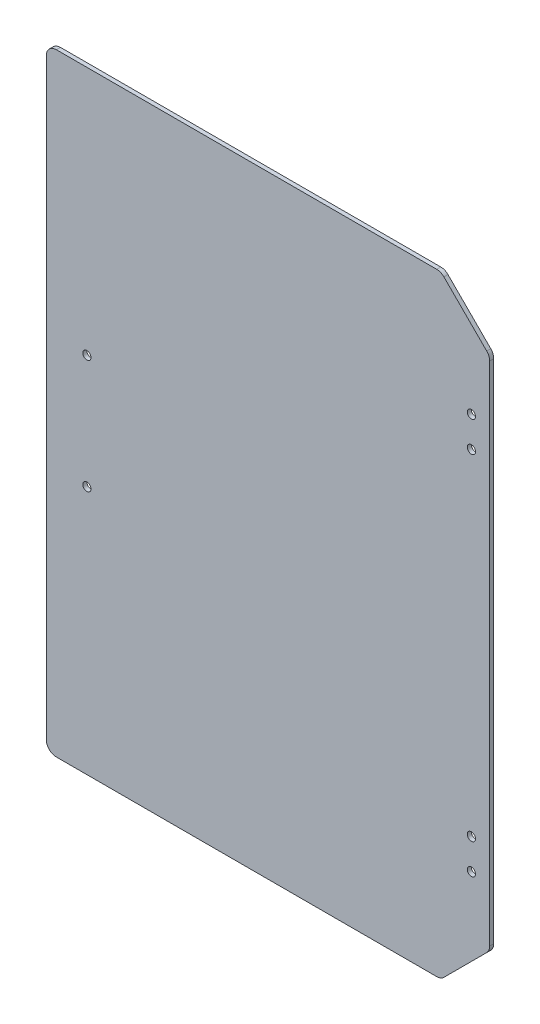
ISO-10303-21;
HEADER;
FILE_DESCRIPTION(('STEP AP214'),'2;1');
FILE_NAME('part.step','',(''),(''),'','','');
FILE_SCHEMA(('AUTOMOTIVE_DESIGN { 1 0 10303 214 1 1 1 1 }'));
ENDSEC;
DATA;
#1=APPLICATION_CONTEXT('core data for automotive mechanical design processes');
#2=APPLICATION_PROTOCOL_DEFINITION('international standard','automotive_design',2000,#1);
#3=PRODUCT_CONTEXT('',#1,'mechanical');
#4=PRODUCT('Part','Part','',(#3));
#5=PRODUCT_RELATED_PRODUCT_CATEGORY('part','',(#4));
#6=PRODUCT_DEFINITION_FORMATION('','',#4);
#7=PRODUCT_DEFINITION_CONTEXT('part definition',#1,'design');
#8=PRODUCT_DEFINITION('design','',#6,#7);
#9=PRODUCT_DEFINITION_SHAPE('','',#8);
#10=(LENGTH_UNIT() NAMED_UNIT(*) SI_UNIT(.MILLI.,.METRE.));
#11=(NAMED_UNIT(*) PLANE_ANGLE_UNIT() SI_UNIT($,.RADIAN.));
#12=(NAMED_UNIT(*) SI_UNIT($,.STERADIAN.) SOLID_ANGLE_UNIT());
#13=UNCERTAINTY_MEASURE_WITH_UNIT(LENGTH_MEASURE(1.E-05),#10,'distance_accuracy_value','');
#14=(GEOMETRIC_REPRESENTATION_CONTEXT(3) GLOBAL_UNCERTAINTY_ASSIGNED_CONTEXT((#13)) GLOBAL_UNIT_ASSIGNED_CONTEXT((#10,
#11,#12)) REPRESENTATION_CONTEXT('',''));
#15=CARTESIAN_POINT('',(0.,0.,0.));
#16=DIRECTION('',(0.,0.,1.));
#17=DIRECTION('',(1.,0.,0.));
#18=AXIS2_PLACEMENT_3D('',#15,#16,#17);
#19=CARTESIAN_POINT('',(0.,0.,4.));
#20=DIRECTION('',(0.,0.,-1.));
#21=DIRECTION('',(-1.,0.,0.));
#22=AXIS2_PLACEMENT_3D('',#19,#20,#21);
#23=PLANE('',#22);
#24=CARTESIAN_POINT('',(-198.144386368956,56.9354419410745,4.));
#25=DIRECTION('',(0.,0.,1.));
#26=DIRECTION('',(1.,0.,0.));
#27=AXIS2_PLACEMENT_3D('',#24,#25,#26);
#28=CIRCLE('',#27,4.04999999999999);
#29=CARTESIAN_POINT('',(-194.094386368956,56.9354419410745,4.));
#30=VERTEX_POINT('',#29);
#31=EDGE_CURVE('E262',#30,#30,#28,.T.);
#32=ORIENTED_EDGE('',*,*,#31,.F.);
#33=EDGE_LOOP('',(#32));
#34=FACE_BOUND('',#33,.T.);
#35=CARTESIAN_POINT('',(-198.144386368956,-55.0645580589255,4.));
#36=DIRECTION('',(0.,0.,1.));
#37=DIRECTION('',(1.,0.,0.));
#38=AXIS2_PLACEMENT_3D('',#35,#36,#37);
#39=CIRCLE('',#38,4.04999999999999);
#40=CARTESIAN_POINT('',(-194.094386368956,-55.0645580589255,4.));
#41=VERTEX_POINT('',#40);
#42=EDGE_CURVE('E256',#41,#41,#39,.T.);
#43=ORIENTED_EDGE('',*,*,#42,.F.);
#44=EDGE_LOOP('',(#43));
#45=FACE_BOUND('',#44,.T.);
#46=DIRECTION('',(-1.,0.,0.));
#47=VECTOR('',#46,1.);
#48=CARTESIAN_POINT('',(-238.144386368956,302.435441941074,4.));
#49=LINE('',#48,#47);
#50=CARTESIAN_POINT('',(146.213478007298,302.435441941074,4.));
#51=VERTEX_POINT('',#50);
#52=CARTESIAN_POINT('',(-228.144386368956,302.435441941074,4.));
#53=VERTEX_POINT('',#52);
#54=EDGE_CURVE('E159',#51,#53,#49,.T.);
#55=ORIENTED_EDGE('',*,*,#54,.T.);
#56=CARTESIAN_POINT('',(-228.144386368956,292.435441941074,4.));
#57=DIRECTION('',(0.,0.,-1.));
#58=DIRECTION('',(-1.,0.,0.));
#59=AXIS2_PLACEMENT_3D('',#56,#57,#58);
#60=CIRCLE('',#59,10.);
#61=CARTESIAN_POINT('',(-238.144386368956,292.435441941074,4.));
#62=VERTEX_POINT('',#61);
#63=EDGE_CURVE('E192',#53,#62,#60,.F.);
#64=ORIENTED_EDGE('',*,*,#63,.T.);
#65=DIRECTION('',(0.,-1.,0.));
#66=VECTOR('',#65,1.);
#67=CARTESIAN_POINT('',(-238.144386368956,-300.564558058925,4.));
#68=LINE('',#67,#66);
#69=CARTESIAN_POINT('',(-238.144386368956,-290.564558058925,4.));
#70=VERTEX_POINT('',#69);
#71=EDGE_CURVE('E142',#62,#70,#68,.T.);
#72=ORIENTED_EDGE('',*,*,#71,.T.);
#73=CARTESIAN_POINT('',(-228.144386368956,-290.564558058925,4.));
#74=DIRECTION('',(0.,0.,-1.));
#75=DIRECTION('',(-1.,0.,0.));
#76=AXIS2_PLACEMENT_3D('',#73,#74,#75);
#77=CIRCLE('',#76,10.);
#78=CARTESIAN_POINT('',(-228.144386368956,-300.564558058925,4.));
#79=VERTEX_POINT('',#78);
#80=EDGE_CURVE('E190',#70,#79,#77,.F.);
#81=ORIENTED_EDGE('',*,*,#80,.T.);
#82=DIRECTION('',(1.,0.,0.));
#83=VECTOR('',#82,1.);
#84=CARTESIAN_POINT('',(-238.144386368956,-300.564558058925,4.));
#85=LINE('',#84,#83);
#86=CARTESIAN_POINT('',(146.2134780073,-300.564558058925,4.));
#87=VERTEX_POINT('',#86);
#88=EDGE_CURVE('E231',#79,#87,#85,.T.);
#89=ORIENTED_EDGE('',*,*,#88,.T.);
#90=CARTESIAN_POINT('',(146.2134780073,-290.564558058925,4.));
#91=DIRECTION('',(0.,0.,-1.));
#92=DIRECTION('',(-1.,0.,0.));
#93=AXIS2_PLACEMENT_3D('',#90,#91,#92);
#94=CIRCLE('',#93,10.);
#95=CARTESIAN_POINT('',(153.284545819165,-297.635625870791,4.));
#96=VERTEX_POINT('',#95);
#97=EDGE_CURVE('E188',#87,#96,#94,.F.);
#98=ORIENTED_EDGE('',*,*,#97,.T.);
#99=DIRECTION('',(0.707106781186548,0.707106781186548,0.));
#100=VECTOR('',#99,1.);
#101=CARTESIAN_POINT('',(150.355613631031,-300.564558058925,4.));
#102=LINE('',#101,#100);
#103=CARTESIAN_POINT('',(195.426681442896,-255.49349024706,4.));
#104=VERTEX_POINT('',#103);
#105=EDGE_CURVE('E226',#96,#104,#102,.T.);
#106=ORIENTED_EDGE('',*,*,#105,.T.);
#107=CARTESIAN_POINT('',(188.355613631031,-248.422422435194,4.));
#108=DIRECTION('',(0.,0.,-1.));
#109=DIRECTION('',(-1.,0.,0.));
#110=AXIS2_PLACEMENT_3D('',#107,#108,#109);
#111=CIRCLE('',#110,10.);
#112=CARTESIAN_POINT('',(198.355613631031,-248.422422435194,4.));
#113=VERTEX_POINT('',#112);
#114=EDGE_CURVE('E186',#104,#113,#111,.F.);
#115=ORIENTED_EDGE('',*,*,#114,.T.);
#116=DIRECTION('',(0.,1.,0.));
#117=VECTOR('',#116,1.);
#118=CARTESIAN_POINT('',(198.355613631031,254.435441941074,4.));
#119=LINE('',#118,#117);
#120=CARTESIAN_POINT('',(198.355613631031,250.293306317343,4.));
#121=VERTEX_POINT('',#120);
#122=EDGE_CURVE('E214',#113,#121,#119,.T.);
#123=ORIENTED_EDGE('',*,*,#122,.T.);
#124=CARTESIAN_POINT('',(188.355613631031,250.293306317343,4.));
#125=DIRECTION('',(0.,0.,-1.));
#126=DIRECTION('',(-1.,0.,0.));
#127=AXIS2_PLACEMENT_3D('',#124,#125,#126);
#128=CIRCLE('',#127,10.);
#129=CARTESIAN_POINT('',(195.426681442896,257.364374129209,4.));
#130=VERTEX_POINT('',#129);
#131=EDGE_CURVE('E53',#121,#130,#128,.F.);
#132=ORIENTED_EDGE('',*,*,#131,.T.);
#133=DIRECTION('',(-0.707106781186557,0.707106781186539,0.));
#134=VECTOR('',#133,1.);
#135=CARTESIAN_POINT('',(150.355613631029,302.435441941074,4.));
#136=LINE('',#135,#134);
#137=CARTESIAN_POINT('',(153.284545819164,299.50650975294,4.));
#138=VERTEX_POINT('',#137);
#139=EDGE_CURVE('E223',#130,#138,#136,.T.);
#140=ORIENTED_EDGE('',*,*,#139,.T.);
#141=CARTESIAN_POINT('',(146.213478007298,292.435441941074,4.));
#142=DIRECTION('',(0.,0.,-1.));
#143=DIRECTION('',(-1.,0.,0.));
#144=AXIS2_PLACEMENT_3D('',#141,#142,#143);
#145=CIRCLE('',#144,10.);
#146=EDGE_CURVE('E183',#138,#51,#145,.F.);
#147=ORIENTED_EDGE('',*,*,#146,.T.);
#148=EDGE_LOOP('',(#55,#64,#72,#81,#89,#98,#106,#115,#123,#132,#140,#147));
#149=FACE_BOUND('',#148,.T.);
#150=CARTESIAN_POINT('',(180.355613631041,195.935441941075,4.));
#151=DIRECTION('',(0.,0.,1.));
#152=DIRECTION('',(1.,0.,0.));
#153=AXIS2_PLACEMENT_3D('',#150,#151,#152);
#154=CIRCLE('',#153,4.04999999999967);
#155=CARTESIAN_POINT('',(184.405613631041,195.935441941075,4.));
#156=VERTEX_POINT('',#155);
#157=EDGE_CURVE('E150',#156,#156,#154,.T.);
#158=ORIENTED_EDGE('',*,*,#157,.F.);
#159=EDGE_LOOP('',(#158));
#160=FACE_BOUND('',#159,.T.);
#161=CARTESIAN_POINT('',(180.355613631041,165.935441941075,4.));
#162=DIRECTION('',(0.,0.,1.));
#163=DIRECTION('',(1.,0.,0.));
#164=AXIS2_PLACEMENT_3D('',#161,#162,#163);
#165=CIRCLE('',#164,4.04999999999967);
#166=CARTESIAN_POINT('',(184.405613631041,165.935441941075,4.));
#167=VERTEX_POINT('',#166);
#168=EDGE_CURVE('E236',#167,#167,#165,.T.);
#169=ORIENTED_EDGE('',*,*,#168,.F.);
#170=EDGE_LOOP('',(#169));
#171=FACE_BOUND('',#170,.T.);
#172=CARTESIAN_POINT('',(180.355613631041,-164.064558058926,4.));
#173=DIRECTION('',(0.,0.,1.));
#174=DIRECTION('',(1.,0.,0.));
#175=AXIS2_PLACEMENT_3D('',#172,#173,#174);
#176=CIRCLE('',#175,4.04999999999967);
#177=CARTESIAN_POINT('',(184.405613631041,-164.064558058926,4.));
#178=VERTEX_POINT('',#177);
#179=EDGE_CURVE('E241',#178,#178,#176,.T.);
#180=ORIENTED_EDGE('',*,*,#179,.F.);
#181=EDGE_LOOP('',(#180));
#182=FACE_BOUND('',#181,.T.);
#183=CARTESIAN_POINT('',(180.355613631041,-194.064558058925,4.));
#184=DIRECTION('',(0.,0.,1.));
#185=DIRECTION('',(1.,0.,0.));
#186=AXIS2_PLACEMENT_3D('',#183,#184,#185);
#187=CIRCLE('',#186,4.04999999999967);
#188=CARTESIAN_POINT('',(184.405613631041,-194.064558058925,4.));
#189=VERTEX_POINT('',#188);
#190=EDGE_CURVE('E247',#189,#189,#187,.T.);
#191=ORIENTED_EDGE('',*,*,#190,.F.);
#192=EDGE_LOOP('',(#191));
#193=FACE_BOUND('',#192,.T.);
#194=ADVANCED_FACE('F32',(#34,#45,#149,#160,#171,#182,#193),#23,.F.);
#195=CARTESIAN_POINT('',(0.,0.,0.));
#196=DIRECTION('',(0.,0.,-1.));
#197=DIRECTION('',(-1.,0.,0.));
#198=AXIS2_PLACEMENT_3D('',#195,#196,#197);
#199=PLANE('',#198);
#200=CARTESIAN_POINT('',(-198.144386368956,56.9354419410745,0.));
#201=DIRECTION('',(0.,0.,1.));
#202=DIRECTION('',(1.,0.,0.));
#203=AXIS2_PLACEMENT_3D('',#200,#201,#202);
#204=CIRCLE('',#203,4.04999999999999);
#205=CARTESIAN_POINT('',(-194.094386368956,56.9354419410745,0.));
#206=VERTEX_POINT('',#205);
#207=EDGE_CURVE('E253',#206,#206,#204,.T.);
#208=ORIENTED_EDGE('',*,*,#207,.T.);
#209=EDGE_LOOP('',(#208));
#210=FACE_BOUND('',#209,.T.);
#211=CARTESIAN_POINT('',(-198.144386368956,-55.0645580589255,0.));
#212=DIRECTION('',(0.,0.,1.));
#213=DIRECTION('',(1.,0.,0.));
#214=AXIS2_PLACEMENT_3D('',#211,#212,#213);
#215=CIRCLE('',#214,4.04999999999999);
#216=CARTESIAN_POINT('',(-194.094386368956,-55.0645580589255,0.));
#217=VERTEX_POINT('',#216);
#218=EDGE_CURVE('E259',#217,#217,#215,.T.);
#219=ORIENTED_EDGE('',*,*,#218,.T.);
#220=EDGE_LOOP('',(#219));
#221=FACE_BOUND('',#220,.T.);
#222=CARTESIAN_POINT('',(180.355613631041,-164.064558058926,0.));
#223=DIRECTION('',(0.,0.,1.));
#224=DIRECTION('',(1.,0.,0.));
#225=AXIS2_PLACEMENT_3D('',#222,#223,#224);
#226=CIRCLE('',#225,4.04999999999967);
#227=CARTESIAN_POINT('',(184.405613631041,-164.064558058926,0.));
#228=VERTEX_POINT('',#227);
#229=EDGE_CURVE('E244',#228,#228,#226,.T.);
#230=ORIENTED_EDGE('',*,*,#229,.T.);
#231=EDGE_LOOP('',(#230));
#232=FACE_BOUND('',#231,.T.);
#233=CARTESIAN_POINT('',(180.355613631041,195.935441941075,0.));
#234=DIRECTION('',(0.,0.,1.));
#235=DIRECTION('',(1.,0.,0.));
#236=AXIS2_PLACEMENT_3D('',#233,#234,#235);
#237=CIRCLE('',#236,4.04999999999967);
#238=CARTESIAN_POINT('',(184.405613631041,195.935441941075,0.));
#239=VERTEX_POINT('',#238);
#240=EDGE_CURVE('E156',#239,#239,#237,.T.);
#241=ORIENTED_EDGE('',*,*,#240,.T.);
#242=EDGE_LOOP('',(#241));
#243=FACE_BOUND('',#242,.T.);
#244=DIRECTION('',(0.,-1.,0.));
#245=VECTOR('',#244,1.);
#246=CARTESIAN_POINT('',(-238.144386368956,-300.564558058925,0.));
#247=LINE('',#246,#245);
#248=CARTESIAN_POINT('',(-238.144386368956,292.435441941074,0.));
#249=VERTEX_POINT('',#248);
#250=CARTESIAN_POINT('',(-238.144386368956,-290.564558058925,0.));
#251=VERTEX_POINT('',#250);
#252=EDGE_CURVE('E139',#249,#251,#247,.T.);
#253=ORIENTED_EDGE('',*,*,#252,.F.);
#254=CARTESIAN_POINT('',(-228.144386368956,292.435441941074,0.));
#255=DIRECTION('',(0.,0.,-1.));
#256=DIRECTION('',(-1.,0.,0.));
#257=AXIS2_PLACEMENT_3D('',#254,#255,#256);
#258=CIRCLE('',#257,10.);
#259=CARTESIAN_POINT('',(-228.144386368956,302.435441941074,0.));
#260=VERTEX_POINT('',#259);
#261=EDGE_CURVE('E122',#249,#260,#258,.T.);
#262=ORIENTED_EDGE('',*,*,#261,.T.);
#263=DIRECTION('',(-1.,0.,0.));
#264=VECTOR('',#263,1.);
#265=CARTESIAN_POINT('',(-238.144386368956,302.435441941074,0.));
#266=LINE('',#265,#264);
#267=CARTESIAN_POINT('',(146.213478007298,302.435441941074,0.));
#268=VERTEX_POINT('',#267);
#269=EDGE_CURVE('E169',#268,#260,#266,.T.);
#270=ORIENTED_EDGE('',*,*,#269,.F.);
#271=CARTESIAN_POINT('',(146.213478007298,292.435441941074,0.));
#272=DIRECTION('',(0.,0.,-1.));
#273=DIRECTION('',(-1.,0.,0.));
#274=AXIS2_PLACEMENT_3D('',#271,#272,#273);
#275=CIRCLE('',#274,10.);
#276=CARTESIAN_POINT('',(153.284545819164,299.50650975294,0.));
#277=VERTEX_POINT('',#276);
#278=EDGE_CURVE('E143',#268,#277,#275,.T.);
#279=ORIENTED_EDGE('',*,*,#278,.T.);
#280=DIRECTION('',(-0.707106781186557,0.707106781186539,0.));
#281=VECTOR('',#280,1.);
#282=CARTESIAN_POINT('',(150.355613631029,302.435441941074,0.));
#283=LINE('',#282,#281);
#284=CARTESIAN_POINT('',(195.426681442896,257.364374129209,0.));
#285=VERTEX_POINT('',#284);
#286=EDGE_CURVE('E167',#285,#277,#283,.T.);
#287=ORIENTED_EDGE('',*,*,#286,.F.);
#288=CARTESIAN_POINT('',(188.355613631031,250.293306317343,0.));
#289=DIRECTION('',(0.,0.,-1.));
#290=DIRECTION('',(-1.,0.,0.));
#291=AXIS2_PLACEMENT_3D('',#288,#289,#290);
#292=CIRCLE('',#291,10.);
#293=CARTESIAN_POINT('',(198.355613631031,250.293306317343,0.));
#294=VERTEX_POINT('',#293);
#295=EDGE_CURVE('E173',#285,#294,#292,.T.);
#296=ORIENTED_EDGE('',*,*,#295,.T.);
#297=DIRECTION('',(0.,1.,0.));
#298=VECTOR('',#297,1.);
#299=CARTESIAN_POINT('',(198.355613631031,254.435441941074,0.));
#300=LINE('',#299,#298);
#301=CARTESIAN_POINT('',(198.355613631031,-248.422422435194,0.));
#302=VERTEX_POINT('',#301);
#303=EDGE_CURVE('E164',#302,#294,#300,.T.);
#304=ORIENTED_EDGE('',*,*,#303,.F.);
#305=CARTESIAN_POINT('',(188.355613631031,-248.422422435194,0.));
#306=DIRECTION('',(0.,0.,-1.));
#307=DIRECTION('',(-1.,0.,0.));
#308=AXIS2_PLACEMENT_3D('',#305,#306,#307);
#309=CIRCLE('',#308,10.);
#310=CARTESIAN_POINT('',(195.426681442896,-255.49349024706,0.));
#311=VERTEX_POINT('',#310);
#312=EDGE_CURVE('E175',#302,#311,#309,.T.);
#313=ORIENTED_EDGE('',*,*,#312,.T.);
#314=DIRECTION('',(0.707106781186548,0.707106781186548,0.));
#315=VECTOR('',#314,1.);
#316=CARTESIAN_POINT('',(150.355613631031,-300.564558058925,0.));
#317=LINE('',#316,#315);
#318=CARTESIAN_POINT('',(153.284545819165,-297.635625870791,0.));
#319=VERTEX_POINT('',#318);
#320=EDGE_CURVE('E153',#319,#311,#317,.T.);
#321=ORIENTED_EDGE('',*,*,#320,.F.);
#322=CARTESIAN_POINT('',(146.2134780073,-290.564558058925,0.));
#323=DIRECTION('',(0.,0.,-1.));
#324=DIRECTION('',(-1.,0.,0.));
#325=AXIS2_PLACEMENT_3D('',#322,#323,#324);
#326=CIRCLE('',#325,10.);
#327=CARTESIAN_POINT('',(146.2134780073,-300.564558058925,0.));
#328=VERTEX_POINT('',#327);
#329=EDGE_CURVE('E177',#319,#328,#326,.T.);
#330=ORIENTED_EDGE('',*,*,#329,.T.);
#331=DIRECTION('',(1.,0.,0.));
#332=VECTOR('',#331,1.);
#333=CARTESIAN_POINT('',(-238.144386368956,-300.564558058925,0.));
#334=LINE('',#333,#332);
#335=CARTESIAN_POINT('',(-228.144386368956,-300.564558058925,0.));
#336=VERTEX_POINT('',#335);
#337=EDGE_CURVE('E149',#336,#328,#334,.T.);
#338=ORIENTED_EDGE('',*,*,#337,.F.);
#339=CARTESIAN_POINT('',(-228.144386368956,-290.564558058925,0.));
#340=DIRECTION('',(0.,0.,-1.));
#341=DIRECTION('',(-1.,0.,0.));
#342=AXIS2_PLACEMENT_3D('',#339,#340,#341);
#343=CIRCLE('',#342,10.);
#344=EDGE_CURVE('E133',#336,#251,#343,.T.);
#345=ORIENTED_EDGE('',*,*,#344,.T.);
#346=EDGE_LOOP('',(#253,#262,#270,#279,#287,#296,#304,#313,#321,#330,#338,#345));
#347=FACE_BOUND('',#346,.T.);
#348=CARTESIAN_POINT('',(180.355613631041,165.935441941075,0.));
#349=DIRECTION('',(0.,0.,1.));
#350=DIRECTION('',(1.,0.,0.));
#351=AXIS2_PLACEMENT_3D('',#348,#349,#350);
#352=CIRCLE('',#351,4.04999999999967);
#353=CARTESIAN_POINT('',(184.405613631041,165.935441941075,0.));
#354=VERTEX_POINT('',#353);
#355=EDGE_CURVE('E238',#354,#354,#352,.T.);
#356=ORIENTED_EDGE('',*,*,#355,.T.);
#357=EDGE_LOOP('',(#356));
#358=FACE_BOUND('',#357,.T.);
#359=CARTESIAN_POINT('',(180.355613631041,-194.064558058925,0.));
#360=DIRECTION('',(0.,0.,1.));
#361=DIRECTION('',(1.,0.,0.));
#362=AXIS2_PLACEMENT_3D('',#359,#360,#361);
#363=CIRCLE('',#362,4.04999999999967);
#364=CARTESIAN_POINT('',(184.405613631041,-194.064558058925,0.));
#365=VERTEX_POINT('',#364);
#366=EDGE_CURVE('E250',#365,#365,#363,.T.);
#367=ORIENTED_EDGE('',*,*,#366,.T.);
#368=EDGE_LOOP('',(#367));
#369=FACE_BOUND('',#368,.T.);
#370=ADVANCED_FACE('F146',(#210,#221,#232,#243,#347,#358,#369),#199,.T.);
#371=CARTESIAN_POINT('',(-238.144386368956,-300.564558058925,4.));
#372=DIRECTION('',(1.,0.,0.));
#373=DIRECTION('',(0.,0.,-1.));
#374=AXIS2_PLACEMENT_3D('',#371,#372,#373);
#375=PLANE('',#374);
#376=ORIENTED_EDGE('',*,*,#71,.F.);
#377=DIRECTION('',(0.,0.,-1.));
#378=VECTOR('',#377,1.);
#379=CARTESIAN_POINT('',(-238.144386368956,292.435441941074,4.));
#380=LINE('',#379,#378);
#381=EDGE_CURVE('E126',#62,#249,#380,.T.);
#382=ORIENTED_EDGE('',*,*,#381,.T.);
#383=ORIENTED_EDGE('',*,*,#252,.T.);
#384=DIRECTION('',(0.,0.,-1.));
#385=VECTOR('',#384,1.);
#386=CARTESIAN_POINT('',(-238.144386368956,-290.564558058925,4.));
#387=LINE('',#386,#385);
#388=EDGE_CURVE('E144',#251,#70,#387,.F.);
#389=ORIENTED_EDGE('',*,*,#388,.T.);
#390=EDGE_LOOP('',(#376,#382,#383,#389));
#391=FACE_BOUND('',#390,.T.);
#392=ADVANCED_FACE('F138',(#391),#375,.F.);
#393=CARTESIAN_POINT('',(-238.144386368956,-300.564558058925,4.));
#394=DIRECTION('',(0.,1.,0.));
#395=DIRECTION('',(-1.,0.,0.));
#396=AXIS2_PLACEMENT_3D('',#393,#394,#395);
#397=PLANE('',#396);
#398=ORIENTED_EDGE('',*,*,#88,.F.);
#399=DIRECTION('',(0.,0.,-1.));
#400=VECTOR('',#399,1.);
#401=CARTESIAN_POINT('',(-228.144386368956,-300.564558058925,4.));
#402=LINE('',#401,#400);
#403=EDGE_CURVE('E196',#79,#336,#402,.T.);
#404=ORIENTED_EDGE('',*,*,#403,.T.);
#405=ORIENTED_EDGE('',*,*,#337,.T.);
#406=DIRECTION('',(0.,0.,-1.));
#407=VECTOR('',#406,1.);
#408=CARTESIAN_POINT('',(146.2134780073,-300.564558058925,4.));
#409=LINE('',#408,#407);
#410=EDGE_CURVE('E194',#328,#87,#409,.F.);
#411=ORIENTED_EDGE('',*,*,#410,.T.);
#412=EDGE_LOOP('',(#398,#404,#405,#411));
#413=FACE_BOUND('',#412,.T.);
#414=ADVANCED_FACE('F303',(#413),#397,.F.);
#415=CARTESIAN_POINT('',(150.355613631031,-300.564558058925,4.));
#416=DIRECTION('',(-0.707106781186547,0.707106781186547,0.));
#417=DIRECTION('',(-0.707106781186548,-0.707106781186548,0.));
#418=AXIS2_PLACEMENT_3D('',#415,#416,#417);
#419=PLANE('',#418);
#420=ORIENTED_EDGE('',*,*,#105,.F.);
#421=DIRECTION('',(0.,0.,-1.));
#422=VECTOR('',#421,1.);
#423=CARTESIAN_POINT('',(153.284545819165,-297.635625870791,4.));
#424=LINE('',#423,#422);
#425=EDGE_CURVE('E201',#96,#319,#424,.T.);
#426=ORIENTED_EDGE('',*,*,#425,.T.);
#427=ORIENTED_EDGE('',*,*,#320,.T.);
#428=DIRECTION('',(0.,0.,-1.));
#429=VECTOR('',#428,1.);
#430=CARTESIAN_POINT('',(195.426681442896,-255.49349024706,4.));
#431=LINE('',#430,#429);
#432=EDGE_CURVE('E199',#311,#104,#431,.F.);
#433=ORIENTED_EDGE('',*,*,#432,.T.);
#434=EDGE_LOOP('',(#420,#426,#427,#433));
#435=FACE_BOUND('',#434,.T.);
#436=ADVANCED_FACE('F316',(#435),#419,.F.);
#437=CARTESIAN_POINT('',(198.355613631031,254.435441941074,4.));
#438=DIRECTION('',(-1.,0.,0.));
#439=DIRECTION('',(0.,0.,1.));
#440=AXIS2_PLACEMENT_3D('',#437,#438,#439);
#441=PLANE('',#440);
#442=ORIENTED_EDGE('',*,*,#122,.F.);
#443=DIRECTION('',(0.,0.,-1.));
#444=VECTOR('',#443,1.);
#445=CARTESIAN_POINT('',(198.355613631031,-248.422422435194,4.));
#446=LINE('',#445,#444);
#447=EDGE_CURVE('E206',#113,#302,#446,.T.);
#448=ORIENTED_EDGE('',*,*,#447,.T.);
#449=ORIENTED_EDGE('',*,*,#303,.T.);
#450=DIRECTION('',(0.,0.,-1.));
#451=VECTOR('',#450,1.);
#452=CARTESIAN_POINT('',(198.355613631031,250.293306317343,4.));
#453=LINE('',#452,#451);
#454=EDGE_CURVE('E204',#294,#121,#453,.F.);
#455=ORIENTED_EDGE('',*,*,#454,.T.);
#456=EDGE_LOOP('',(#442,#448,#449,#455));
#457=FACE_BOUND('',#456,.T.);
#458=ADVANCED_FACE('F212',(#457),#441,.F.);
#459=CARTESIAN_POINT('',(150.355613631029,302.435441941074,4.));
#460=DIRECTION('',(-0.707106781186539,-0.707106781186557,0.));
#461=DIRECTION('',(0.707106781186557,-0.707106781186539,0.));
#462=AXIS2_PLACEMENT_3D('',#459,#460,#461);
#463=PLANE('',#462);
#464=ORIENTED_EDGE('',*,*,#139,.F.);
#465=DIRECTION('',(0.,0.,-1.));
#466=VECTOR('',#465,1.);
#467=CARTESIAN_POINT('',(195.426681442896,257.364374129209,4.));
#468=LINE('',#467,#466);
#469=EDGE_CURVE('E11',#130,#285,#468,.T.);
#470=ORIENTED_EDGE('',*,*,#469,.T.);
#471=ORIENTED_EDGE('',*,*,#286,.T.);
#472=DIRECTION('',(0.,0.,-1.));
#473=VECTOR('',#472,1.);
#474=CARTESIAN_POINT('',(153.284545819164,299.50650975294,4.));
#475=LINE('',#474,#473);
#476=EDGE_CURVE('E40',#277,#138,#475,.F.);
#477=ORIENTED_EDGE('',*,*,#476,.T.);
#478=EDGE_LOOP('',(#464,#470,#471,#477));
#479=FACE_BOUND('',#478,.T.);
#480=ADVANCED_FACE('F222',(#479),#463,.F.);
#481=CARTESIAN_POINT('',(-238.144386368956,302.435441941074,4.));
#482=DIRECTION('',(0.,-1.,0.));
#483=DIRECTION('',(1.,0.,0.));
#484=AXIS2_PLACEMENT_3D('',#481,#482,#483);
#485=PLANE('',#484);
#486=ORIENTED_EDGE('',*,*,#269,.T.);
#487=DIRECTION('',(0.,0.,-1.));
#488=VECTOR('',#487,1.);
#489=CARTESIAN_POINT('',(-228.144386368956,302.435441941074,4.));
#490=LINE('',#489,#488);
#491=EDGE_CURVE('E127',#260,#53,#490,.F.);
#492=ORIENTED_EDGE('',*,*,#491,.T.);
#493=ORIENTED_EDGE('',*,*,#54,.F.);
#494=DIRECTION('',(0.,0.,-1.));
#495=VECTOR('',#494,1.);
#496=CARTESIAN_POINT('',(146.213478007298,302.435441941074,4.));
#497=LINE('',#496,#495);
#498=EDGE_CURVE('E132',#51,#268,#497,.T.);
#499=ORIENTED_EDGE('',*,*,#498,.T.);
#500=EDGE_LOOP('',(#486,#492,#493,#499));
#501=FACE_BOUND('',#500,.T.);
#502=ADVANCED_FACE('F307',(#501),#485,.F.);
#503=CARTESIAN_POINT('',(180.355613631041,195.935441941075,4.));
#504=DIRECTION('',(0.,0.,-1.));
#505=DIRECTION('',(-1.,0.,0.));
#506=AXIS2_PLACEMENT_3D('',#503,#504,#505);
#507=CYLINDRICAL_SURFACE('',#506,4.04999999999967);
#508=ORIENTED_EDGE('',*,*,#157,.T.);
#509=EDGE_LOOP('',(#508));
#510=FACE_BOUND('',#509,.T.);
#511=ORIENTED_EDGE('',*,*,#240,.F.);
#512=EDGE_LOOP('',(#511));
#513=FACE_BOUND('',#512,.T.);
#514=ADVANCED_FACE('F310',(#510,#513),#507,.F.);
#515=CARTESIAN_POINT('',(180.355613631041,165.935441941075,4.));
#516=DIRECTION('',(0.,0.,-1.));
#517=DIRECTION('',(-1.,0.,0.));
#518=AXIS2_PLACEMENT_3D('',#515,#516,#517);
#519=CYLINDRICAL_SURFACE('',#518,4.04999999999967);
#520=ORIENTED_EDGE('',*,*,#168,.T.);
#521=EDGE_LOOP('',(#520));
#522=FACE_BOUND('',#521,.T.);
#523=ORIENTED_EDGE('',*,*,#355,.F.);
#524=EDGE_LOOP('',(#523));
#525=FACE_BOUND('',#524,.T.);
#526=ADVANCED_FACE('F353',(#522,#525),#519,.F.);
#527=CARTESIAN_POINT('',(180.355613631041,-164.064558058926,4.));
#528=DIRECTION('',(0.,0.,-1.));
#529=DIRECTION('',(-1.,0.,0.));
#530=AXIS2_PLACEMENT_3D('',#527,#528,#529);
#531=CYLINDRICAL_SURFACE('',#530,4.04999999999967);
#532=ORIENTED_EDGE('',*,*,#179,.T.);
#533=EDGE_LOOP('',(#532));
#534=FACE_BOUND('',#533,.T.);
#535=ORIENTED_EDGE('',*,*,#229,.F.);
#536=EDGE_LOOP('',(#535));
#537=FACE_BOUND('',#536,.T.);
#538=ADVANCED_FACE('F294',(#534,#537),#531,.F.);
#539=CARTESIAN_POINT('',(180.355613631041,-194.064558058925,4.));
#540=DIRECTION('',(0.,0.,-1.));
#541=DIRECTION('',(-1.,0.,0.));
#542=AXIS2_PLACEMENT_3D('',#539,#540,#541);
#543=CYLINDRICAL_SURFACE('',#542,4.04999999999967);
#544=ORIENTED_EDGE('',*,*,#190,.T.);
#545=EDGE_LOOP('',(#544));
#546=FACE_BOUND('',#545,.T.);
#547=ORIENTED_EDGE('',*,*,#366,.F.);
#548=EDGE_LOOP('',(#547));
#549=FACE_BOUND('',#548,.T.);
#550=ADVANCED_FACE('F291',(#546,#549),#543,.F.);
#551=CARTESIAN_POINT('',(-228.144386368956,292.435441941074,4.));
#552=DIRECTION('',(0.,0.,-1.));
#553=DIRECTION('',(-1.,0.,0.));
#554=AXIS2_PLACEMENT_3D('',#551,#552,#553);
#555=CYLINDRICAL_SURFACE('',#554,10.);
#556=ORIENTED_EDGE('',*,*,#63,.F.);
#557=ORIENTED_EDGE('',*,*,#491,.F.);
#558=ORIENTED_EDGE('',*,*,#261,.F.);
#559=ORIENTED_EDGE('',*,*,#381,.F.);
#560=EDGE_LOOP('',(#556,#557,#558,#559));
#561=FACE_BOUND('',#560,.T.);
#562=ADVANCED_FACE('F125',(#561),#555,.T.);
#563=CARTESIAN_POINT('',(-228.144386368956,-290.564558058925,4.));
#564=DIRECTION('',(0.,0.,-1.));
#565=DIRECTION('',(-1.,0.,0.));
#566=AXIS2_PLACEMENT_3D('',#563,#564,#565);
#567=CYLINDRICAL_SURFACE('',#566,10.);
#568=ORIENTED_EDGE('',*,*,#80,.F.);
#569=ORIENTED_EDGE('',*,*,#388,.F.);
#570=ORIENTED_EDGE('',*,*,#344,.F.);
#571=ORIENTED_EDGE('',*,*,#403,.F.);
#572=EDGE_LOOP('',(#568,#569,#570,#571));
#573=FACE_BOUND('',#572,.T.);
#574=ADVANCED_FACE('F325',(#573),#567,.T.);
#575=CARTESIAN_POINT('',(146.2134780073,-290.564558058925,4.));
#576=DIRECTION('',(0.,0.,-1.));
#577=DIRECTION('',(-1.,0.,0.));
#578=AXIS2_PLACEMENT_3D('',#575,#576,#577);
#579=CYLINDRICAL_SURFACE('',#578,10.);
#580=ORIENTED_EDGE('',*,*,#97,.F.);
#581=ORIENTED_EDGE('',*,*,#410,.F.);
#582=ORIENTED_EDGE('',*,*,#329,.F.);
#583=ORIENTED_EDGE('',*,*,#425,.F.);
#584=EDGE_LOOP('',(#580,#581,#582,#583));
#585=FACE_BOUND('',#584,.T.);
#586=ADVANCED_FACE('F328',(#585),#579,.T.);
#587=CARTESIAN_POINT('',(188.355613631031,-248.422422435194,4.));
#588=DIRECTION('',(0.,0.,-1.));
#589=DIRECTION('',(-1.,0.,0.));
#590=AXIS2_PLACEMENT_3D('',#587,#588,#589);
#591=CYLINDRICAL_SURFACE('',#590,10.);
#592=ORIENTED_EDGE('',*,*,#114,.F.);
#593=ORIENTED_EDGE('',*,*,#432,.F.);
#594=ORIENTED_EDGE('',*,*,#312,.F.);
#595=ORIENTED_EDGE('',*,*,#447,.F.);
#596=EDGE_LOOP('',(#592,#593,#594,#595));
#597=FACE_BOUND('',#596,.T.);
#598=ADVANCED_FACE('F332',(#597),#591,.T.);
#599=CARTESIAN_POINT('',(188.355613631031,250.293306317343,4.));
#600=DIRECTION('',(0.,0.,-1.));
#601=DIRECTION('',(-1.,0.,0.));
#602=AXIS2_PLACEMENT_3D('',#599,#600,#601);
#603=CYLINDRICAL_SURFACE('',#602,10.);
#604=ORIENTED_EDGE('',*,*,#131,.F.);
#605=ORIENTED_EDGE('',*,*,#454,.F.);
#606=ORIENTED_EDGE('',*,*,#295,.F.);
#607=ORIENTED_EDGE('',*,*,#469,.F.);
#608=EDGE_LOOP('',(#604,#605,#606,#607));
#609=FACE_BOUND('',#608,.T.);
#610=ADVANCED_FACE('F221',(#609),#603,.T.);
#611=CARTESIAN_POINT('',(146.213478007298,292.435441941074,4.));
#612=DIRECTION('',(0.,0.,-1.));
#613=DIRECTION('',(-1.,0.,0.));
#614=AXIS2_PLACEMENT_3D('',#611,#612,#613);
#615=CYLINDRICAL_SURFACE('',#614,10.);
#616=ORIENTED_EDGE('',*,*,#146,.F.);
#617=ORIENTED_EDGE('',*,*,#476,.F.);
#618=ORIENTED_EDGE('',*,*,#278,.F.);
#619=ORIENTED_EDGE('',*,*,#498,.F.);
#620=EDGE_LOOP('',(#616,#617,#618,#619));
#621=FACE_BOUND('',#620,.T.);
#622=ADVANCED_FACE('F34',(#621),#615,.T.);
#623=CARTESIAN_POINT('',(-198.144386368956,-55.0645580589255,0.));
#624=DIRECTION('',(0.,0.,1.));
#625=DIRECTION('',(1.,0.,0.));
#626=AXIS2_PLACEMENT_3D('',#623,#624,#625);
#627=CYLINDRICAL_SURFACE('',#626,4.04999999999999);
#628=ORIENTED_EDGE('',*,*,#218,.F.);
#629=EDGE_LOOP('',(#628));
#630=FACE_BOUND('',#629,.T.);
#631=ORIENTED_EDGE('',*,*,#42,.T.);
#632=EDGE_LOOP('',(#631));
#633=FACE_BOUND('',#632,.T.);
#634=ADVANCED_FACE('F273',(#630,#633),#627,.F.);
#635=CARTESIAN_POINT('',(-198.144386368956,56.9354419410745,0.));
#636=DIRECTION('',(0.,0.,1.));
#637=DIRECTION('',(1.,0.,0.));
#638=AXIS2_PLACEMENT_3D('',#635,#636,#637);
#639=CYLINDRICAL_SURFACE('',#638,4.04999999999999);
#640=ORIENTED_EDGE('',*,*,#207,.F.);
#641=EDGE_LOOP('',(#640));
#642=FACE_BOUND('',#641,.T.);
#643=ORIENTED_EDGE('',*,*,#31,.T.);
#644=EDGE_LOOP('',(#643));
#645=FACE_BOUND('',#644,.T.);
#646=ADVANCED_FACE('F270',(#642,#645),#639,.F.);
#647=CLOSED_SHELL('',(#194,#370,#392,#414,#436,#458,#480,#502,#514,#526,#538,#550,#562,#574,
#586,#598,#610,#622,#634,#646));
#648=MANIFOLD_SOLID_BREP('B2',#647);
#649=ADVANCED_BREP_SHAPE_REPRESENTATION('',(#18,#648),#14);
#650=SHAPE_DEFINITION_REPRESENTATION(#9,#649);
ENDSEC;
END-ISO-10303-21;
